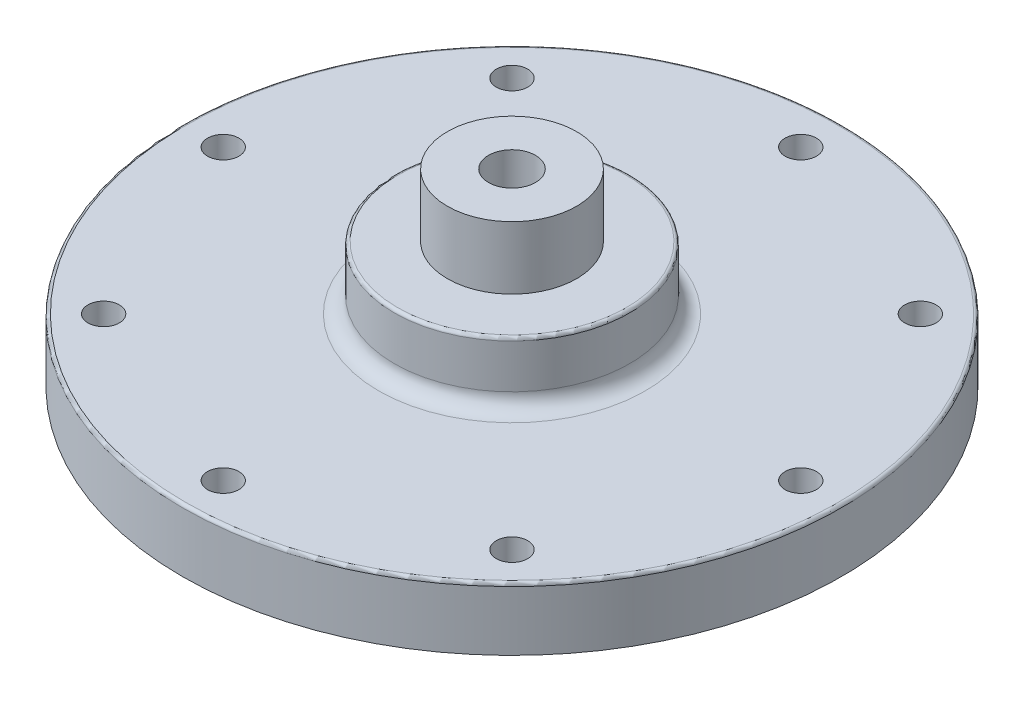
ISO-10303-21;
HEADER;
FILE_DESCRIPTION(('STEP AP214'),'2;1');
FILE_NAME('part.step','',(''),(''),'','','');
FILE_SCHEMA(('AUTOMOTIVE_DESIGN { 1 0 10303 214 1 1 1 1 }'));
ENDSEC;
DATA;
#1=APPLICATION_CONTEXT('core data for automotive mechanical design processes');
#2=APPLICATION_PROTOCOL_DEFINITION('international standard','automotive_design',2000,#1);
#3=PRODUCT_CONTEXT('',#1,'mechanical');
#4=PRODUCT('Part','Part','',(#3));
#5=PRODUCT_RELATED_PRODUCT_CATEGORY('part','',(#4));
#6=PRODUCT_DEFINITION_FORMATION('','',#4);
#7=PRODUCT_DEFINITION_CONTEXT('part definition',#1,'design');
#8=PRODUCT_DEFINITION('design','',#6,#7);
#9=PRODUCT_DEFINITION_SHAPE('','',#8);
#10=(LENGTH_UNIT() NAMED_UNIT(*) SI_UNIT(.MILLI.,.METRE.));
#11=(NAMED_UNIT(*) PLANE_ANGLE_UNIT() SI_UNIT($,.RADIAN.));
#12=(NAMED_UNIT(*) SI_UNIT($,.STERADIAN.) SOLID_ANGLE_UNIT());
#13=UNCERTAINTY_MEASURE_WITH_UNIT(LENGTH_MEASURE(1.E-05),#10,'distance_accuracy_value','');
#14=(GEOMETRIC_REPRESENTATION_CONTEXT(3) GLOBAL_UNCERTAINTY_ASSIGNED_CONTEXT((#13)) GLOBAL_UNIT_ASSIGNED_CONTEXT((#10,
#11,#12)) REPRESENTATION_CONTEXT('',''));
#15=CARTESIAN_POINT('',(0.,0.,0.));
#16=DIRECTION('',(0.,0.,1.));
#17=DIRECTION('',(1.,0.,0.));
#18=AXIS2_PLACEMENT_3D('',#15,#16,#17);
#19=CARTESIAN_POINT('',(0.,12.7,0.));
#20=DIRECTION('',(0.,-1.,0.));
#21=DIRECTION('',(0.,0.,-1.));
#22=AXIS2_PLACEMENT_3D('',#19,#20,#21);
#23=CYLINDRICAL_SURFACE('',#22,66.675);
#24=CARTESIAN_POINT('',(0.,12.065,0.));
#25=DIRECTION('',(0.,1.,0.));
#26=DIRECTION('',(0.,0.,1.));
#27=AXIS2_PLACEMENT_3D('',#24,#25,#26);
#28=CIRCLE('',#27,66.675);
#29=CARTESIAN_POINT('',(0.,12.065,66.675));
#30=VERTEX_POINT('',#29);
#31=EDGE_CURVE('E12',#30,#30,#28,.F.);
#32=ORIENTED_EDGE('',*,*,#31,.T.);
#33=EDGE_LOOP('',(#32));
#34=FACE_BOUND('',#33,.T.);
#35=CARTESIAN_POINT('',(0.,0.,0.));
#36=DIRECTION('',(0.,1.,0.));
#37=DIRECTION('',(0.,0.,1.));
#38=AXIS2_PLACEMENT_3D('',#35,#36,#37);
#39=CIRCLE('',#38,66.675);
#40=CARTESIAN_POINT('',(0.,0.,66.675));
#41=VERTEX_POINT('',#40);
#42=EDGE_CURVE('E183',#41,#41,#39,.T.);
#43=ORIENTED_EDGE('',*,*,#42,.T.);
#44=EDGE_LOOP('',(#43));
#45=FACE_BOUND('',#44,.T.);
#46=ADVANCED_FACE('F42',(#34,#45),#23,.T.);
#47=CARTESIAN_POINT('',(0.,12.7,0.));
#48=DIRECTION('',(0.,1.,0.));
#49=DIRECTION('',(0.,0.,1.));
#50=AXIS2_PLACEMENT_3D('',#47,#48,#49);
#51=PLANE('',#50);
#52=CARTESIAN_POINT('',(0.,12.7,0.));
#53=DIRECTION('',(0.,1.,0.));
#54=DIRECTION('',(0.,0.,1.));
#55=AXIS2_PLACEMENT_3D('',#52,#53,#54);
#56=CIRCLE('',#55,66.04);
#57=CARTESIAN_POINT('',(0.,12.7,66.04));
#58=VERTEX_POINT('',#57);
#59=EDGE_CURVE('E51',#58,#58,#56,.T.);
#60=ORIENTED_EDGE('',*,*,#59,.T.);
#61=EDGE_LOOP('',(#60));
#62=FACE_BOUND('',#61,.T.);
#63=CARTESIAN_POINT('',(0.,12.7,0.));
#64=DIRECTION('',(0.,1.,0.));
#65=DIRECTION('',(0.,0.,1.));
#66=AXIS2_PLACEMENT_3D('',#63,#64,#65);
#67=CIRCLE('',#66,26.9875);
#68=CARTESIAN_POINT('',(0.,12.7,26.9875));
#69=VERTEX_POINT('',#68);
#70=EDGE_CURVE('E182',#69,#69,#67,.F.);
#71=ORIENTED_EDGE('',*,*,#70,.T.);
#72=EDGE_LOOP('',(#71));
#73=FACE_BOUND('',#72,.T.);
#74=CARTESIAN_POINT('',(41.3091781569223,12.7,41.3091781569164));
#75=DIRECTION('',(0.,1.,0.));
#76=DIRECTION('',(0.,0.,1.));
#77=AXIS2_PLACEMENT_3D('',#74,#75,#76);
#78=CIRCLE('',#77,3.17499999999999);
#79=CARTESIAN_POINT('',(41.3091781569223,12.7,44.4841781569163));
#80=VERTEX_POINT('',#79);
#81=EDGE_CURVE('E364',#80,#80,#78,.T.);
#82=ORIENTED_EDGE('',*,*,#81,.F.);
#83=EDGE_LOOP('',(#82));
#84=FACE_BOUND('',#83,.T.);
#85=CARTESIAN_POINT('',(4.96688002157137E-12,12.7,58.42));
#86=DIRECTION('',(0.,1.,0.));
#87=DIRECTION('',(0.,0.,1.));
#88=AXIS2_PLACEMENT_3D('',#85,#86,#87);
#89=CIRCLE('',#88,3.17499999999999);
#90=CARTESIAN_POINT('',(4.96688002157137E-12,12.7,61.595));
#91=VERTEX_POINT('',#90);
#92=EDGE_CURVE('E372',#91,#91,#89,.T.);
#93=ORIENTED_EDGE('',*,*,#92,.F.);
#94=EDGE_LOOP('',(#93));
#95=FACE_BOUND('',#94,.T.);
#96=CARTESIAN_POINT('',(-41.3091781569139,12.7,41.3091781569199));
#97=DIRECTION('',(0.,1.,0.));
#98=DIRECTION('',(0.,0.,1.));
#99=AXIS2_PLACEMENT_3D('',#96,#97,#98);
#100=CIRCLE('',#99,3.17499999999998);
#101=CARTESIAN_POINT('',(-41.3091781569139,12.7,44.4841781569199));
#102=VERTEX_POINT('',#101);
#103=EDGE_CURVE('E380',#102,#102,#100,.T.);
#104=ORIENTED_EDGE('',*,*,#103,.F.);
#105=EDGE_LOOP('',(#104));
#106=FACE_BOUND('',#105,.T.);
#107=CARTESIAN_POINT('',(-58.4199999999975,12.7,2.4905943973863E-12));
#108=DIRECTION('',(0.,1.,0.));
#109=DIRECTION('',(0.,0.,1.));
#110=AXIS2_PLACEMENT_3D('',#107,#108,#109);
#111=CIRCLE('',#110,3.17499999999999);
#112=CARTESIAN_POINT('',(-58.4199999999975,12.7,3.17500000000248));
#113=VERTEX_POINT('',#112);
#114=EDGE_CURVE('E388',#113,#113,#111,.T.);
#115=ORIENTED_EDGE('',*,*,#114,.F.);
#116=EDGE_LOOP('',(#115));
#117=FACE_BOUND('',#116,.T.);
#118=CARTESIAN_POINT('',(-41.3091781569174,12.7,-41.3091781569163));
#119=DIRECTION('',(0.,1.,0.));
#120=DIRECTION('',(0.,0.,1.));
#121=AXIS2_PLACEMENT_3D('',#118,#119,#120);
#122=CIRCLE('',#121,3.17499999999998);
#123=CARTESIAN_POINT('',(-41.3091781569174,12.7,-38.1341781569164));
#124=VERTEX_POINT('',#123);
#125=EDGE_CURVE('E396',#124,#124,#122,.T.);
#126=ORIENTED_EDGE('',*,*,#125,.F.);
#127=EDGE_LOOP('',(#126));
#128=FACE_BOUND('',#127,.T.);
#129=CARTESIAN_POINT('',(0.,12.7,-58.42));
#130=DIRECTION('',(0.,1.,0.));
#131=DIRECTION('',(0.,0.,1.));
#132=AXIS2_PLACEMENT_3D('',#129,#130,#131);
#133=CIRCLE('',#132,3.17499999999999);
#134=CARTESIAN_POINT('',(0.,12.7,-55.245));
#135=VERTEX_POINT('',#134);
#136=EDGE_CURVE('E404',#135,#135,#133,.T.);
#137=ORIENTED_EDGE('',*,*,#136,.F.);
#138=EDGE_LOOP('',(#137));
#139=FACE_BOUND('',#138,.T.);
#140=CARTESIAN_POINT('',(41.3091781569188,12.7,-41.3091781569199));
#141=DIRECTION('',(0.,1.,0.));
#142=DIRECTION('',(0.,0.,1.));
#143=AXIS2_PLACEMENT_3D('',#140,#141,#142);
#144=CIRCLE('',#143,3.17499999999998);
#145=CARTESIAN_POINT('',(41.3091781569188,12.7,-38.1341781569199));
#146=VERTEX_POINT('',#145);
#147=EDGE_CURVE('E312',#146,#146,#144,.T.);
#148=ORIENTED_EDGE('',*,*,#147,.F.);
#149=EDGE_LOOP('',(#148));
#150=FACE_BOUND('',#149,.T.);
#151=CARTESIAN_POINT('',(58.4200000000025,12.7,-2.48344001078568E-12));
#152=DIRECTION('',(0.,1.,0.));
#153=DIRECTION('',(0.,0.,1.));
#154=AXIS2_PLACEMENT_3D('',#151,#152,#153);
#155=CIRCLE('',#154,3.17499999999999);
#156=CARTESIAN_POINT('',(58.4200000000025,12.7,3.17499999999751));
#157=VERTEX_POINT('',#156);
#158=EDGE_CURVE('E303',#157,#157,#155,.T.);
#159=ORIENTED_EDGE('',*,*,#158,.F.);
#160=EDGE_LOOP('',(#159));
#161=FACE_BOUND('',#160,.T.);
#162=ADVANCED_FACE('F198',(#62,#73,#84,#95,#106,#117,#128,#139,#150,#161),#51,.T.);
#163=CARTESIAN_POINT('',(0.,0.,0.));
#164=DIRECTION('',(0.,1.,0.));
#165=DIRECTION('',(0.,0.,1.));
#166=AXIS2_PLACEMENT_3D('',#163,#164,#165);
#167=PLANE('',#166);
#168=CARTESIAN_POINT('',(0.,0.,0.));
#169=DIRECTION('',(0.,-1.,0.));
#170=DIRECTION('',(0.,0.,-1.));
#171=AXIS2_PLACEMENT_3D('',#168,#169,#170);
#172=CIRCLE('',#171,23.8125);
#173=CARTESIAN_POINT('',(0.,0.,-23.8125));
#174=VERTEX_POINT('',#173);
#175=EDGE_CURVE('E169',#174,#174,#172,.T.);
#176=ORIENTED_EDGE('',*,*,#175,.F.);
#177=EDGE_LOOP('',(#176));
#178=FACE_BOUND('',#177,.T.);
#179=CARTESIAN_POINT('',(-22.3563661187695,0.,53.9730422893092));
#180=DIRECTION('',(0.,-1.,0.));
#181=DIRECTION('',(0.,0.,-1.));
#182=AXIS2_PLACEMENT_3D('',#179,#180,#181);
#183=CIRCLE('',#182,3.175);
#184=CARTESIAN_POINT('',(-22.3563661187695,0.,50.7980422893092));
#185=VERTEX_POINT('',#184);
#186=EDGE_CURVE('E348',#185,#185,#183,.T.);
#187=ORIENTED_EDGE('',*,*,#186,.F.);
#188=EDGE_LOOP('',(#187));
#189=FACE_BOUND('',#188,.T.);
#190=CARTESIAN_POINT('',(22.3563661187682,0.,-53.9730422893095));
#191=DIRECTION('',(0.,-1.,0.));
#192=DIRECTION('',(0.,0.,-1.));
#193=AXIS2_PLACEMENT_3D('',#190,#191,#192);
#194=CIRCLE('',#193,3.175);
#195=CARTESIAN_POINT('',(22.3563661187682,0.,-57.1480422893095));
#196=VERTEX_POINT('',#195);
#197=EDGE_CURVE('E356',#196,#196,#194,.T.);
#198=ORIENTED_EDGE('',*,*,#197,.F.);
#199=EDGE_LOOP('',(#198));
#200=FACE_BOUND('',#199,.T.);
#201=CARTESIAN_POINT('',(41.3091781569223,0.,41.3091781569164));
#202=DIRECTION('',(0.,1.,0.));
#203=DIRECTION('',(0.,0.,1.));
#204=AXIS2_PLACEMENT_3D('',#201,#202,#203);
#205=CIRCLE('',#204,3.17499999999999);
#206=CARTESIAN_POINT('',(41.3091781569223,0.,44.4841781569163));
#207=VERTEX_POINT('',#206);
#208=EDGE_CURVE('E368',#207,#207,#205,.T.);
#209=ORIENTED_EDGE('',*,*,#208,.T.);
#210=EDGE_LOOP('',(#209));
#211=FACE_BOUND('',#210,.T.);
#212=CARTESIAN_POINT('',(4.96688002157137E-12,0.,58.42));
#213=DIRECTION('',(0.,1.,0.));
#214=DIRECTION('',(0.,0.,1.));
#215=AXIS2_PLACEMENT_3D('',#212,#213,#214);
#216=CIRCLE('',#215,3.17499999999999);
#217=CARTESIAN_POINT('',(4.96688002157137E-12,0.,61.595));
#218=VERTEX_POINT('',#217);
#219=EDGE_CURVE('E376',#218,#218,#216,.T.);
#220=ORIENTED_EDGE('',*,*,#219,.T.);
#221=EDGE_LOOP('',(#220));
#222=FACE_BOUND('',#221,.T.);
#223=CARTESIAN_POINT('',(-41.3091781569139,0.,41.3091781569199));
#224=DIRECTION('',(0.,1.,0.));
#225=DIRECTION('',(0.,0.,1.));
#226=AXIS2_PLACEMENT_3D('',#223,#224,#225);
#227=CIRCLE('',#226,3.17499999999999);
#228=CARTESIAN_POINT('',(-41.3091781569139,0.,44.4841781569199));
#229=VERTEX_POINT('',#228);
#230=EDGE_CURVE('E384',#229,#229,#227,.T.);
#231=ORIENTED_EDGE('',*,*,#230,.T.);
#232=EDGE_LOOP('',(#231));
#233=FACE_BOUND('',#232,.T.);
#234=CARTESIAN_POINT('',(-58.4199999999975,0.,2.4905943973863E-12));
#235=DIRECTION('',(0.,1.,0.));
#236=DIRECTION('',(0.,0.,1.));
#237=AXIS2_PLACEMENT_3D('',#234,#235,#236);
#238=CIRCLE('',#237,3.17499999999999);
#239=CARTESIAN_POINT('',(-58.4199999999975,0.,3.17500000000248));
#240=VERTEX_POINT('',#239);
#241=EDGE_CURVE('E392',#240,#240,#238,.T.);
#242=ORIENTED_EDGE('',*,*,#241,.T.);
#243=EDGE_LOOP('',(#242));
#244=FACE_BOUND('',#243,.T.);
#245=CARTESIAN_POINT('',(-41.3091781569174,0.,-41.3091781569163));
#246=DIRECTION('',(0.,1.,0.));
#247=DIRECTION('',(0.,0.,1.));
#248=AXIS2_PLACEMENT_3D('',#245,#246,#247);
#249=CIRCLE('',#248,3.17499999999999);
#250=CARTESIAN_POINT('',(-41.3091781569174,0.,-38.1341781569164));
#251=VERTEX_POINT('',#250);
#252=EDGE_CURVE('E400',#251,#251,#249,.T.);
#253=ORIENTED_EDGE('',*,*,#252,.T.);
#254=EDGE_LOOP('',(#253));
#255=FACE_BOUND('',#254,.T.);
#256=CARTESIAN_POINT('',(0.,0.,-58.42));
#257=DIRECTION('',(0.,1.,0.));
#258=DIRECTION('',(0.,0.,1.));
#259=AXIS2_PLACEMENT_3D('',#256,#257,#258);
#260=CIRCLE('',#259,3.17499999999999);
#261=CARTESIAN_POINT('',(0.,0.,-55.245));
#262=VERTEX_POINT('',#261);
#263=EDGE_CURVE('E408',#262,#262,#260,.T.);
#264=ORIENTED_EDGE('',*,*,#263,.T.);
#265=EDGE_LOOP('',(#264));
#266=FACE_BOUND('',#265,.T.);
#267=CARTESIAN_POINT('',(41.3091781569188,0.,-41.3091781569199));
#268=DIRECTION('',(0.,1.,0.));
#269=DIRECTION('',(0.,0.,1.));
#270=AXIS2_PLACEMENT_3D('',#267,#268,#269);
#271=CIRCLE('',#270,3.17499999999999);
#272=CARTESIAN_POINT('',(41.3091781569188,0.,-38.1341781569199));
#273=VERTEX_POINT('',#272);
#274=EDGE_CURVE('E306',#273,#273,#271,.T.);
#275=ORIENTED_EDGE('',*,*,#274,.T.);
#276=EDGE_LOOP('',(#275));
#277=FACE_BOUND('',#276,.T.);
#278=CARTESIAN_POINT('',(58.4200000000025,0.,-2.48344001078568E-12));
#279=DIRECTION('',(0.,1.,0.));
#280=DIRECTION('',(0.,0.,1.));
#281=AXIS2_PLACEMENT_3D('',#278,#279,#280);
#282=CIRCLE('',#281,3.17499999999999);
#283=CARTESIAN_POINT('',(58.4200000000025,0.,3.17499999999751));
#284=VERTEX_POINT('',#283);
#285=EDGE_CURVE('E300',#284,#284,#282,.T.);
#286=ORIENTED_EDGE('',*,*,#285,.T.);
#287=EDGE_LOOP('',(#286));
#288=FACE_BOUND('',#287,.T.);
#289=ORIENTED_EDGE('',*,*,#42,.F.);
#290=EDGE_LOOP('',(#289));
#291=FACE_BOUND('',#290,.T.);
#292=ADVANCED_FACE('F216',(#178,#189,#200,#211,#222,#233,#244,#255,#266,#277,#288,#291),#167,.F.);
#293=CARTESIAN_POINT('',(58.4200000000025,12.7,-2.48344001078568E-12));
#294=DIRECTION('',(0.,1.,0.));
#295=DIRECTION('',(0.,0.,1.));
#296=AXIS2_PLACEMENT_3D('',#293,#294,#295);
#297=CYLINDRICAL_SURFACE('',#296,3.17499999999999);
#298=ORIENTED_EDGE('',*,*,#285,.F.);
#299=EDGE_LOOP('',(#298));
#300=FACE_BOUND('',#299,.T.);
#301=ORIENTED_EDGE('',*,*,#158,.T.);
#302=EDGE_LOOP('',(#301));
#303=FACE_BOUND('',#302,.T.);
#304=ADVANCED_FACE('F289',(#300,#303),#297,.F.);
#305=CARTESIAN_POINT('',(41.3091781569188,12.7,-41.3091781569199));
#306=DIRECTION('',(0.,1.,0.));
#307=DIRECTION('',(0.,0.,1.));
#308=AXIS2_PLACEMENT_3D('',#305,#306,#307);
#309=CYLINDRICAL_SURFACE('',#308,3.17499999999999);
#310=ORIENTED_EDGE('',*,*,#274,.F.);
#311=EDGE_LOOP('',(#310));
#312=FACE_BOUND('',#311,.T.);
#313=ORIENTED_EDGE('',*,*,#147,.T.);
#314=EDGE_LOOP('',(#313));
#315=FACE_BOUND('',#314,.T.);
#316=ADVANCED_FACE('F285',(#312,#315),#309,.F.);
#317=CARTESIAN_POINT('',(0.,12.7,-58.42));
#318=DIRECTION('',(0.,1.,0.));
#319=DIRECTION('',(0.,0.,1.));
#320=AXIS2_PLACEMENT_3D('',#317,#318,#319);
#321=CYLINDRICAL_SURFACE('',#320,3.17499999999999);
#322=ORIENTED_EDGE('',*,*,#263,.F.);
#323=EDGE_LOOP('',(#322));
#324=FACE_BOUND('',#323,.T.);
#325=ORIENTED_EDGE('',*,*,#136,.T.);
#326=EDGE_LOOP('',(#325));
#327=FACE_BOUND('',#326,.T.);
#328=ADVANCED_FACE('F281',(#324,#327),#321,.F.);
#329=CARTESIAN_POINT('',(-41.3091781569174,12.7,-41.3091781569163));
#330=DIRECTION('',(0.,1.,0.));
#331=DIRECTION('',(0.,0.,1.));
#332=AXIS2_PLACEMENT_3D('',#329,#330,#331);
#333=CYLINDRICAL_SURFACE('',#332,3.17499999999999);
#334=ORIENTED_EDGE('',*,*,#252,.F.);
#335=EDGE_LOOP('',(#334));
#336=FACE_BOUND('',#335,.T.);
#337=ORIENTED_EDGE('',*,*,#125,.T.);
#338=EDGE_LOOP('',(#337));
#339=FACE_BOUND('',#338,.T.);
#340=ADVANCED_FACE('F277',(#336,#339),#333,.F.);
#341=CARTESIAN_POINT('',(-58.4199999999975,12.7,2.4905943973863E-12));
#342=DIRECTION('',(0.,1.,0.));
#343=DIRECTION('',(0.,0.,1.));
#344=AXIS2_PLACEMENT_3D('',#341,#342,#343);
#345=CYLINDRICAL_SURFACE('',#344,3.17499999999999);
#346=ORIENTED_EDGE('',*,*,#241,.F.);
#347=EDGE_LOOP('',(#346));
#348=FACE_BOUND('',#347,.T.);
#349=ORIENTED_EDGE('',*,*,#114,.T.);
#350=EDGE_LOOP('',(#349));
#351=FACE_BOUND('',#350,.T.);
#352=ADVANCED_FACE('F273',(#348,#351),#345,.F.);
#353=CARTESIAN_POINT('',(-41.3091781569139,12.7,41.3091781569199));
#354=DIRECTION('',(0.,1.,0.));
#355=DIRECTION('',(0.,0.,1.));
#356=AXIS2_PLACEMENT_3D('',#353,#354,#355);
#357=CYLINDRICAL_SURFACE('',#356,3.17499999999999);
#358=ORIENTED_EDGE('',*,*,#230,.F.);
#359=EDGE_LOOP('',(#358));
#360=FACE_BOUND('',#359,.T.);
#361=ORIENTED_EDGE('',*,*,#103,.T.);
#362=EDGE_LOOP('',(#361));
#363=FACE_BOUND('',#362,.T.);
#364=ADVANCED_FACE('F269',(#360,#363),#357,.F.);
#365=CARTESIAN_POINT('',(4.96688002157137E-12,12.7,58.42));
#366=DIRECTION('',(0.,1.,0.));
#367=DIRECTION('',(0.,0.,1.));
#368=AXIS2_PLACEMENT_3D('',#365,#366,#367);
#369=CYLINDRICAL_SURFACE('',#368,3.17499999999999);
#370=ORIENTED_EDGE('',*,*,#219,.F.);
#371=EDGE_LOOP('',(#370));
#372=FACE_BOUND('',#371,.T.);
#373=ORIENTED_EDGE('',*,*,#92,.T.);
#374=EDGE_LOOP('',(#373));
#375=FACE_BOUND('',#374,.T.);
#376=ADVANCED_FACE('F265',(#372,#375),#369,.F.);
#377=CARTESIAN_POINT('',(41.3091781569223,12.7,41.3091781569164));
#378=DIRECTION('',(0.,1.,0.));
#379=DIRECTION('',(0.,0.,1.));
#380=AXIS2_PLACEMENT_3D('',#377,#378,#379);
#381=CYLINDRICAL_SURFACE('',#380,3.17499999999999);
#382=ORIENTED_EDGE('',*,*,#208,.F.);
#383=EDGE_LOOP('',(#382));
#384=FACE_BOUND('',#383,.T.);
#385=ORIENTED_EDGE('',*,*,#81,.T.);
#386=EDGE_LOOP('',(#385));
#387=FACE_BOUND('',#386,.T.);
#388=ADVANCED_FACE('F262',(#384,#387),#381,.F.);
#389=CARTESIAN_POINT('',(22.3563661187682,6.35,-53.9730422893095));
#390=DIRECTION('',(0.,-1.,0.));
#391=DIRECTION('',(0.,0.,-1.));
#392=AXIS2_PLACEMENT_3D('',#389,#390,#391);
#393=CONICAL_SURFACE('',#392,3.175,1.02974425867665);
#394=CARTESIAN_POINT('',(22.3563661187682,8.25773246541251,-53.9730422893095));
#395=VERTEX_POINT('',#394);
#396=VERTEX_LOOP('',#395);
#397=FACE_BOUND('',#396,.T.);
#398=CARTESIAN_POINT('',(22.3563661187682,6.35,-53.9730422893095));
#399=DIRECTION('',(0.,-1.,0.));
#400=DIRECTION('',(0.,0.,-1.));
#401=AXIS2_PLACEMENT_3D('',#398,#399,#400);
#402=CIRCLE('',#401,3.175);
#403=CARTESIAN_POINT('',(22.3563661187682,6.35,-57.1480422893095));
#404=VERTEX_POINT('',#403);
#405=EDGE_CURVE('E360',#404,#404,#402,.T.);
#406=ORIENTED_EDGE('',*,*,#405,.T.);
#407=EDGE_LOOP('',(#406));
#408=FACE_BOUND('',#407,.T.);
#409=ADVANCED_FACE('F258',(#397,#408),#393,.F.);
#410=CARTESIAN_POINT('',(22.3563661187682,0.,-53.9730422893095));
#411=DIRECTION('',(0.,-1.,0.));
#412=DIRECTION('',(0.,0.,-1.));
#413=AXIS2_PLACEMENT_3D('',#410,#411,#412);
#414=CYLINDRICAL_SURFACE('',#413,3.175);
#415=ORIENTED_EDGE('',*,*,#405,.F.);
#416=EDGE_LOOP('',(#415));
#417=FACE_BOUND('',#416,.T.);
#418=ORIENTED_EDGE('',*,*,#197,.T.);
#419=EDGE_LOOP('',(#418));
#420=FACE_BOUND('',#419,.T.);
#421=ADVANCED_FACE('F255',(#417,#420),#414,.F.);
#422=CARTESIAN_POINT('',(-22.3563661187695,6.35,53.9730422893092));
#423=DIRECTION('',(0.,-1.,0.));
#424=DIRECTION('',(0.,0.,-1.));
#425=AXIS2_PLACEMENT_3D('',#422,#423,#424);
#426=CONICAL_SURFACE('',#425,3.175,1.02974425867665);
#427=CARTESIAN_POINT('',(-22.3563661187695,8.25773246541251,53.9730422893092));
#428=VERTEX_POINT('',#427);
#429=VERTEX_LOOP('',#428);
#430=FACE_BOUND('',#429,.T.);
#431=CARTESIAN_POINT('',(-22.3563661187695,6.35,53.9730422893092));
#432=DIRECTION('',(0.,-1.,0.));
#433=DIRECTION('',(0.,0.,-1.));
#434=AXIS2_PLACEMENT_3D('',#431,#432,#433);
#435=CIRCLE('',#434,3.175);
#436=CARTESIAN_POINT('',(-22.3563661187695,6.35,50.7980422893092));
#437=VERTEX_POINT('',#436);
#438=EDGE_CURVE('E352',#437,#437,#435,.T.);
#439=ORIENTED_EDGE('',*,*,#438,.T.);
#440=EDGE_LOOP('',(#439));
#441=FACE_BOUND('',#440,.T.);
#442=ADVANCED_FACE('F251',(#430,#441),#426,.F.);
#443=CARTESIAN_POINT('',(-22.3563661187695,0.,53.9730422893092));
#444=DIRECTION('',(0.,-1.,0.));
#445=DIRECTION('',(0.,0.,-1.));
#446=AXIS2_PLACEMENT_3D('',#443,#444,#445);
#447=CYLINDRICAL_SURFACE('',#446,3.175);
#448=ORIENTED_EDGE('',*,*,#438,.F.);
#449=EDGE_LOOP('',(#448));
#450=FACE_BOUND('',#449,.T.);
#451=ORIENTED_EDGE('',*,*,#186,.T.);
#452=EDGE_LOOP('',(#451));
#453=FACE_BOUND('',#452,.T.);
#454=ADVANCED_FACE('F244',(#450,#453),#447,.F.);
#455=CARTESIAN_POINT('',(0.,25.4,0.));
#456=DIRECTION('',(0.,1.,0.));
#457=DIRECTION('',(0.,0.,1.));
#458=AXIS2_PLACEMENT_3D('',#455,#456,#457);
#459=PLANE('',#458);
#460=CARTESIAN_POINT('',(0.,25.4,0.));
#461=DIRECTION('',(0.,1.,0.));
#462=DIRECTION('',(0.,0.,1.));
#463=AXIS2_PLACEMENT_3D('',#460,#461,#462);
#464=CIRCLE('',#463,23.1775);
#465=CARTESIAN_POINT('',(0.,25.4,23.1775));
#466=VERTEX_POINT('',#465);
#467=EDGE_CURVE('E187',#466,#466,#464,.T.);
#468=ORIENTED_EDGE('',*,*,#467,.T.);
#469=EDGE_LOOP('',(#468));
#470=FACE_BOUND('',#469,.T.);
#471=CARTESIAN_POINT('',(0.,25.4,0.));
#472=DIRECTION('',(0.,1.,0.));
#473=DIRECTION('',(0.,0.,1.));
#474=AXIS2_PLACEMENT_3D('',#471,#472,#473);
#475=CIRCLE('',#474,13.081);
#476=CARTESIAN_POINT('',(0.,25.4,13.081));
#477=VERTEX_POINT('',#476);
#478=EDGE_CURVE('E335',#477,#477,#475,.T.);
#479=ORIENTED_EDGE('',*,*,#478,.F.);
#480=EDGE_LOOP('',(#479));
#481=FACE_BOUND('',#480,.T.);
#482=ADVANCED_FACE('F234',(#470,#481),#459,.T.);
#483=CARTESIAN_POINT('',(0.,25.4,0.));
#484=DIRECTION('',(0.,-1.,0.));
#485=DIRECTION('',(0.,0.,-1.));
#486=AXIS2_PLACEMENT_3D('',#483,#484,#485);
#487=CYLINDRICAL_SURFACE('',#486,23.8125);
#488=CARTESIAN_POINT('',(0.,24.765,0.));
#489=DIRECTION('',(0.,1.,0.));
#490=DIRECTION('',(0.,0.,1.));
#491=AXIS2_PLACEMENT_3D('',#488,#489,#490);
#492=CIRCLE('',#491,23.8125);
#493=CARTESIAN_POINT('',(0.,24.765,23.8125));
#494=VERTEX_POINT('',#493);
#495=EDGE_CURVE('E191',#494,#494,#492,.F.);
#496=ORIENTED_EDGE('',*,*,#495,.T.);
#497=EDGE_LOOP('',(#496));
#498=FACE_BOUND('',#497,.T.);
#499=CARTESIAN_POINT('',(0.,15.875,0.));
#500=DIRECTION('',(0.,1.,0.));
#501=DIRECTION('',(0.,0.,1.));
#502=AXIS2_PLACEMENT_3D('',#499,#500,#501);
#503=CIRCLE('',#502,23.8125);
#504=CARTESIAN_POINT('',(0.,15.875,23.8125));
#505=VERTEX_POINT('',#504);
#506=EDGE_CURVE('E178',#505,#505,#503,.T.);
#507=ORIENTED_EDGE('',*,*,#506,.T.);
#508=EDGE_LOOP('',(#507));
#509=FACE_BOUND('',#508,.T.);
#510=ADVANCED_FACE('F231',(#498,#509),#487,.T.);
#511=CARTESIAN_POINT('',(0.,25.4,0.));
#512=DIRECTION('',(0.,1.,0.));
#513=DIRECTION('',(0.,0.,1.));
#514=AXIS2_PLACEMENT_3D('',#511,#512,#513);
#515=PLANE('',#514);
#516=CARTESIAN_POINT('',(0.,25.4,0.));
#517=DIRECTION('',(0.,1.,0.));
#518=DIRECTION('',(0.,0.,1.));
#519=AXIS2_PLACEMENT_3D('',#516,#517,#518);
#520=CIRCLE('',#519,4.7625);
#521=CARTESIAN_POINT('',(0.,25.4,4.7625));
#522=VERTEX_POINT('',#521);
#523=EDGE_CURVE('E327',#522,#522,#520,.T.);
#524=ORIENTED_EDGE('',*,*,#523,.T.);
#525=EDGE_LOOP('',(#524));
#526=FACE_BOUND('',#525,.T.);
#527=CARTESIAN_POINT('',(0.,25.4,0.));
#528=DIRECTION('',(0.,1.,0.));
#529=DIRECTION('',(0.,0.,1.));
#530=AXIS2_PLACEMENT_3D('',#527,#528,#529);
#531=CIRCLE('',#530,12.7);
#532=CARTESIAN_POINT('',(0.,25.4,12.7));
#533=VERTEX_POINT('',#532);
#534=EDGE_CURVE('E341',#533,#533,#531,.T.);
#535=ORIENTED_EDGE('',*,*,#534,.F.);
#536=EDGE_LOOP('',(#535));
#537=FACE_BOUND('',#536,.T.);
#538=ADVANCED_FACE('F233',(#526,#537),#515,.F.);
#539=CARTESIAN_POINT('',(0.,38.1,0.));
#540=DIRECTION('',(0.,1.,0.));
#541=DIRECTION('',(0.,0.,1.));
#542=AXIS2_PLACEMENT_3D('',#539,#540,#541);
#543=PLANE('',#542);
#544=CARTESIAN_POINT('',(0.,38.1,0.));
#545=DIRECTION('',(0.,1.,0.));
#546=DIRECTION('',(0.,0.,1.));
#547=AXIS2_PLACEMENT_3D('',#544,#545,#546);
#548=CIRCLE('',#547,13.081);
#549=CARTESIAN_POINT('',(0.,38.1,13.081));
#550=VERTEX_POINT('',#549);
#551=EDGE_CURVE('E337',#550,#550,#548,.T.);
#552=ORIENTED_EDGE('',*,*,#551,.T.);
#553=EDGE_LOOP('',(#552));
#554=FACE_BOUND('',#553,.T.);
#555=CARTESIAN_POINT('',(0.,38.1,0.));
#556=DIRECTION('',(0.,1.,0.));
#557=DIRECTION('',(0.,0.,1.));
#558=AXIS2_PLACEMENT_3D('',#555,#556,#557);
#559=CIRCLE('',#558,4.7625);
#560=CARTESIAN_POINT('',(0.,38.1,4.7625));
#561=VERTEX_POINT('',#560);
#562=EDGE_CURVE('E330',#561,#561,#559,.T.);
#563=ORIENTED_EDGE('',*,*,#562,.F.);
#564=EDGE_LOOP('',(#563));
#565=FACE_BOUND('',#564,.T.);
#566=ADVANCED_FACE('F241',(#554,#565),#543,.T.);
#567=CARTESIAN_POINT('',(0.,38.1,0.));
#568=DIRECTION('',(0.,-1.,0.));
#569=DIRECTION('',(0.,0.,-1.));
#570=AXIS2_PLACEMENT_3D('',#567,#568,#569);
#571=CYLINDRICAL_SURFACE('',#570,13.081);
#572=ORIENTED_EDGE('',*,*,#551,.F.);
#573=EDGE_LOOP('',(#572));
#574=FACE_BOUND('',#573,.T.);
#575=ORIENTED_EDGE('',*,*,#478,.T.);
#576=EDGE_LOOP('',(#575));
#577=FACE_BOUND('',#576,.T.);
#578=ADVANCED_FACE('F581',(#574,#577),#571,.T.);
#579=CARTESIAN_POINT('',(0.,38.1,0.));
#580=DIRECTION('',(0.,-1.,0.));
#581=DIRECTION('',(0.,0.,-1.));
#582=AXIS2_PLACEMENT_3D('',#579,#580,#581);
#583=CYLINDRICAL_SURFACE('',#582,4.7625);
#584=ORIENTED_EDGE('',*,*,#562,.T.);
#585=EDGE_LOOP('',(#584));
#586=FACE_BOUND('',#585,.T.);
#587=ORIENTED_EDGE('',*,*,#523,.F.);
#588=EDGE_LOOP('',(#587));
#589=FACE_BOUND('',#588,.T.);
#590=ADVANCED_FACE('F466',(#586,#589),#583,.F.);
#591=CARTESIAN_POINT('',(0.,25.4,0.));
#592=DIRECTION('',(0.,-1.,0.));
#593=DIRECTION('',(0.,0.,-1.));
#594=AXIS2_PLACEMENT_3D('',#591,#592,#593);
#595=CYLINDRICAL_SURFACE('',#594,12.7);
#596=ORIENTED_EDGE('',*,*,#534,.T.);
#597=EDGE_LOOP('',(#596));
#598=FACE_BOUND('',#597,.T.);
#599=CARTESIAN_POINT('',(0.,6.35,0.));
#600=DIRECTION('',(0.,-1.,0.));
#601=DIRECTION('',(0.,0.,-1.));
#602=AXIS2_PLACEMENT_3D('',#599,#600,#601);
#603=CIRCLE('',#602,12.7);
#604=CARTESIAN_POINT('',(0.,6.35,-12.7));
#605=VERTEX_POINT('',#604);
#606=EDGE_CURVE('E111',#605,#605,#603,.T.);
#607=ORIENTED_EDGE('',*,*,#606,.T.);
#608=EDGE_LOOP('',(#607));
#609=FACE_BOUND('',#608,.T.);
#610=ADVANCED_FACE('F323',(#598,#609),#595,.F.);
#611=CARTESIAN_POINT('',(0.,5.715,0.));
#612=DIRECTION('',(0.,-1.,0.));
#613=DIRECTION('',(0.,0.,-1.));
#614=AXIS2_PLACEMENT_3D('',#611,#612,#613);
#615=CYLINDRICAL_SURFACE('',#614,23.8125);
#616=CARTESIAN_POINT('',(0.,5.715,0.));
#617=DIRECTION('',(0.,-1.,0.));
#618=DIRECTION('',(0.,0.,-1.));
#619=AXIS2_PLACEMENT_3D('',#616,#617,#618);
#620=CIRCLE('',#619,23.8125);
#621=CARTESIAN_POINT('',(0.,5.715,-23.8125));
#622=VERTEX_POINT('',#621);
#623=EDGE_CURVE('E164',#622,#622,#620,.T.);
#624=ORIENTED_EDGE('',*,*,#623,.F.);
#625=EDGE_LOOP('',(#624));
#626=FACE_BOUND('',#625,.T.);
#627=ORIENTED_EDGE('',*,*,#175,.T.);
#628=EDGE_LOOP('',(#627));
#629=FACE_BOUND('',#628,.T.);
#630=ADVANCED_FACE('F140',(#626,#629),#615,.F.);
#631=CARTESIAN_POINT('',(0.,6.35,0.));
#632=DIRECTION('',(0.,-1.,0.));
#633=DIRECTION('',(0.,0.,-1.));
#634=AXIS2_PLACEMENT_3D('',#631,#632,#633);
#635=PLANE('',#634);
#636=CARTESIAN_POINT('',(0.,6.35,-17.4625));
#637=DIRECTION('',(0.,-1.,0.));
#638=DIRECTION('',(0.,0.,-1.));
#639=AXIS2_PLACEMENT_3D('',#636,#637,#638);
#640=CIRCLE('',#639,1.89864999999999);
#641=CARTESIAN_POINT('',(0.,6.35,-19.36115));
#642=VERTEX_POINT('',#641);
#643=EDGE_CURVE('E82',#642,#642,#640,.T.);
#644=ORIENTED_EDGE('',*,*,#643,.F.);
#645=EDGE_LOOP('',(#644));
#646=FACE_BOUND('',#645,.T.);
#647=CARTESIAN_POINT('',(-17.4625,6.35,0.));
#648=DIRECTION('',(0.,-1.,0.));
#649=DIRECTION('',(0.,0.,-1.));
#650=AXIS2_PLACEMENT_3D('',#647,#648,#649);
#651=CIRCLE('',#650,1.89864999999999);
#652=CARTESIAN_POINT('',(-17.4625,6.35,-1.89864999999993));
#653=VERTEX_POINT('',#652);
#654=EDGE_CURVE('E81',#653,#653,#651,.T.);
#655=ORIENTED_EDGE('',*,*,#654,.F.);
#656=EDGE_LOOP('',(#655));
#657=FACE_BOUND('',#656,.T.);
#658=CARTESIAN_POINT('',(1.21939985759096E-13,6.35,17.4625));
#659=DIRECTION('',(0.,-1.,0.));
#660=DIRECTION('',(0.,0.,-1.));
#661=AXIS2_PLACEMENT_3D('',#658,#659,#660);
#662=CIRCLE('',#661,1.89864999999999);
#663=CARTESIAN_POINT('',(1.21939985759096E-13,6.35,15.56385));
#664=VERTEX_POINT('',#663);
#665=EDGE_CURVE('E95',#664,#664,#662,.T.);
#666=ORIENTED_EDGE('',*,*,#665,.F.);
#667=EDGE_LOOP('',(#666));
#668=FACE_BOUND('',#667,.T.);
#669=CARTESIAN_POINT('',(17.4625,6.35,-1.82909978638645E-13));
#670=DIRECTION('',(0.,-1.,0.));
#671=DIRECTION('',(0.,0.,-1.));
#672=AXIS2_PLACEMENT_3D('',#669,#670,#671);
#673=CIRCLE('',#672,1.89864999999999);
#674=CARTESIAN_POINT('',(17.4625,6.35,-1.89865000000017));
#675=VERTEX_POINT('',#674);
#676=EDGE_CURVE('E103',#675,#675,#673,.T.);
#677=ORIENTED_EDGE('',*,*,#676,.F.);
#678=EDGE_LOOP('',(#677));
#679=FACE_BOUND('',#678,.T.);
#680=ORIENTED_EDGE('',*,*,#606,.F.);
#681=EDGE_LOOP('',(#680));
#682=FACE_BOUND('',#681,.T.);
#683=CARTESIAN_POINT('',(0.,6.35,0.));
#684=DIRECTION('',(0.,-1.,0.));
#685=DIRECTION('',(0.,0.,-1.));
#686=AXIS2_PLACEMENT_3D('',#683,#684,#685);
#687=CIRCLE('',#686,23.749);
#688=CARTESIAN_POINT('',(0.,6.35,-23.749));
#689=VERTEX_POINT('',#688);
#690=EDGE_CURVE('E115',#689,#689,#687,.T.);
#691=ORIENTED_EDGE('',*,*,#690,.T.);
#692=EDGE_LOOP('',(#691));
#693=FACE_BOUND('',#692,.T.);
#694=ADVANCED_FACE('F137',(#646,#657,#668,#679,#682,#693),#635,.T.);
#695=CARTESIAN_POINT('',(0.,6.35,0.));
#696=DIRECTION('',(0.,-1.,0.));
#697=DIRECTION('',(0.,0.,-1.));
#698=AXIS2_PLACEMENT_3D('',#695,#696,#697);
#699=CONICAL_SURFACE('',#698,23.749,0.0996686524911582);
#700=ORIENTED_EDGE('',*,*,#690,.F.);
#701=EDGE_LOOP('',(#700));
#702=FACE_BOUND('',#701,.T.);
#703=ORIENTED_EDGE('',*,*,#623,.T.);
#704=EDGE_LOOP('',(#703));
#705=FACE_BOUND('',#704,.T.);
#706=ADVANCED_FACE('F126',(#702,#705),#699,.F.);
#707=CARTESIAN_POINT('',(17.4625,19.05,-1.82909978638645E-13));
#708=DIRECTION('',(0.,-1.,0.));
#709=DIRECTION('',(0.,0.,-1.));
#710=AXIS2_PLACEMENT_3D('',#707,#708,#709);
#711=CONICAL_SURFACE('',#710,1.89865,1.02974425867665);
#712=CARTESIAN_POINT('',(17.4625,20.1908240143167,-1.82909978638645E-13));
#713=VERTEX_POINT('',#712);
#714=VERTEX_LOOP('',#713);
#715=FACE_BOUND('',#714,.T.);
#716=CARTESIAN_POINT('',(17.4625,19.05,-1.82909978638645E-13));
#717=DIRECTION('',(0.,-1.,0.));
#718=DIRECTION('',(0.,0.,-1.));
#719=AXIS2_PLACEMENT_3D('',#716,#717,#718);
#720=CIRCLE('',#719,1.89865);
#721=CARTESIAN_POINT('',(17.4625,19.05,-1.89865000000018));
#722=VERTEX_POINT('',#721);
#723=EDGE_CURVE('E107',#722,#722,#720,.T.);
#724=ORIENTED_EDGE('',*,*,#723,.T.);
#725=EDGE_LOOP('',(#724));
#726=FACE_BOUND('',#725,.T.);
#727=ADVANCED_FACE('F136',(#715,#726),#711,.F.);
#728=CARTESIAN_POINT('',(17.4625,6.35,-1.82909978638645E-13));
#729=DIRECTION('',(0.,-1.,0.));
#730=DIRECTION('',(0.,0.,-1.));
#731=AXIS2_PLACEMENT_3D('',#728,#729,#730);
#732=CYLINDRICAL_SURFACE('',#731,1.89864999999999);
#733=ORIENTED_EDGE('',*,*,#723,.F.);
#734=EDGE_LOOP('',(#733));
#735=FACE_BOUND('',#734,.T.);
#736=ORIENTED_EDGE('',*,*,#676,.T.);
#737=EDGE_LOOP('',(#736));
#738=FACE_BOUND('',#737,.T.);
#739=ADVANCED_FACE('F481',(#735,#738),#732,.F.);
#740=CARTESIAN_POINT('',(1.21939985759096E-13,19.05,17.4625));
#741=DIRECTION('',(0.,-1.,0.));
#742=DIRECTION('',(0.,0.,-1.));
#743=AXIS2_PLACEMENT_3D('',#740,#741,#742);
#744=CONICAL_SURFACE('',#743,1.89865,1.02974425867665);
#745=CARTESIAN_POINT('',(1.18549961593757E-13,20.1908240143167,17.4625));
#746=VERTEX_POINT('',#745);
#747=VERTEX_LOOP('',#746);
#748=FACE_BOUND('',#747,.T.);
#749=CARTESIAN_POINT('',(1.21939985759096E-13,19.05,17.4625));
#750=DIRECTION('',(0.,-1.,0.));
#751=DIRECTION('',(0.,0.,-1.));
#752=AXIS2_PLACEMENT_3D('',#749,#750,#751);
#753=CIRCLE('',#752,1.89865);
#754=CARTESIAN_POINT('',(1.21939985759096E-13,19.05,15.56385));
#755=VERTEX_POINT('',#754);
#756=EDGE_CURVE('E99',#755,#755,#753,.T.);
#757=ORIENTED_EDGE('',*,*,#756,.T.);
#758=EDGE_LOOP('',(#757));
#759=FACE_BOUND('',#758,.T.);
#760=ADVANCED_FACE('F483',(#748,#759),#744,.F.);
#761=CARTESIAN_POINT('',(1.21939985759096E-13,6.35,17.4625));
#762=DIRECTION('',(0.,-1.,0.));
#763=DIRECTION('',(0.,0.,-1.));
#764=AXIS2_PLACEMENT_3D('',#761,#762,#763);
#765=CYLINDRICAL_SURFACE('',#764,1.89864999999999);
#766=ORIENTED_EDGE('',*,*,#756,.F.);
#767=EDGE_LOOP('',(#766));
#768=FACE_BOUND('',#767,.T.);
#769=ORIENTED_EDGE('',*,*,#665,.T.);
#770=EDGE_LOOP('',(#769));
#771=FACE_BOUND('',#770,.T.);
#772=ADVANCED_FACE('F490',(#768,#771),#765,.F.);
#773=CARTESIAN_POINT('',(-17.4625,19.05,0.));
#774=DIRECTION('',(0.,-1.,0.));
#775=DIRECTION('',(0.,0.,-1.));
#776=AXIS2_PLACEMENT_3D('',#773,#774,#775);
#777=CONICAL_SURFACE('',#776,1.89865,1.02974425867665);
#778=CARTESIAN_POINT('',(-17.4625,20.1908240143167,0.));
#779=VERTEX_POINT('',#778);
#780=VERTEX_LOOP('',#779);
#781=FACE_BOUND('',#780,.T.);
#782=CARTESIAN_POINT('',(-17.4625,19.05,0.));
#783=DIRECTION('',(0.,-1.,0.));
#784=DIRECTION('',(0.,0.,-1.));
#785=AXIS2_PLACEMENT_3D('',#782,#783,#784);
#786=CIRCLE('',#785,1.89865);
#787=CARTESIAN_POINT('',(-17.4625,19.05,-1.89864999999994));
#788=VERTEX_POINT('',#787);
#789=EDGE_CURVE('E87',#788,#788,#786,.T.);
#790=ORIENTED_EDGE('',*,*,#789,.T.);
#791=EDGE_LOOP('',(#790));
#792=FACE_BOUND('',#791,.T.);
#793=ADVANCED_FACE('F498',(#781,#792),#777,.F.);
#794=CARTESIAN_POINT('',(-17.4625,6.35,0.));
#795=DIRECTION('',(0.,-1.,0.));
#796=DIRECTION('',(0.,0.,-1.));
#797=AXIS2_PLACEMENT_3D('',#794,#795,#796);
#798=CYLINDRICAL_SURFACE('',#797,1.89864999999999);
#799=ORIENTED_EDGE('',*,*,#789,.F.);
#800=EDGE_LOOP('',(#799));
#801=FACE_BOUND('',#800,.T.);
#802=ORIENTED_EDGE('',*,*,#654,.T.);
#803=EDGE_LOOP('',(#802));
#804=FACE_BOUND('',#803,.T.);
#805=ADVANCED_FACE('F74',(#801,#804),#798,.F.);
#806=CARTESIAN_POINT('',(0.,19.05,-17.4625));
#807=DIRECTION('',(0.,-1.,0.));
#808=DIRECTION('',(0.,0.,-1.));
#809=AXIS2_PLACEMENT_3D('',#806,#807,#808);
#810=CONICAL_SURFACE('',#809,1.89865,1.02974425867665);
#811=CARTESIAN_POINT('',(0.,20.1908240143167,-17.4625));
#812=VERTEX_POINT('',#811);
#813=VERTEX_LOOP('',#812);
#814=FACE_BOUND('',#813,.T.);
#815=CARTESIAN_POINT('',(0.,19.05,-17.4625));
#816=DIRECTION('',(0.,-1.,0.));
#817=DIRECTION('',(0.,0.,-1.));
#818=AXIS2_PLACEMENT_3D('',#815,#816,#817);
#819=CIRCLE('',#818,1.89865);
#820=CARTESIAN_POINT('',(0.,19.05,-19.36115));
#821=VERTEX_POINT('',#820);
#822=EDGE_CURVE('E78',#821,#821,#819,.T.);
#823=ORIENTED_EDGE('',*,*,#822,.T.);
#824=EDGE_LOOP('',(#823));
#825=FACE_BOUND('',#824,.T.);
#826=ADVANCED_FACE('F70',(#814,#825),#810,.F.);
#827=CARTESIAN_POINT('',(0.,6.35,-17.4625));
#828=DIRECTION('',(0.,-1.,0.));
#829=DIRECTION('',(0.,0.,-1.));
#830=AXIS2_PLACEMENT_3D('',#827,#828,#829);
#831=CYLINDRICAL_SURFACE('',#830,1.89864999999999);
#832=ORIENTED_EDGE('',*,*,#822,.F.);
#833=EDGE_LOOP('',(#832));
#834=FACE_BOUND('',#833,.T.);
#835=ORIENTED_EDGE('',*,*,#643,.T.);
#836=EDGE_LOOP('',(#835));
#837=FACE_BOUND('',#836,.T.);
#838=ADVANCED_FACE('F73',(#834,#837),#831,.F.);
#839=CARTESIAN_POINT('',(0.,15.875,0.));
#840=DIRECTION('',(0.,1.,0.));
#841=DIRECTION('',(0.,0.,1.));
#842=AXIS2_PLACEMENT_3D('',#839,#840,#841);
#843=TOROIDAL_SURFACE('',#842,26.9875,3.175);
#844=ORIENTED_EDGE('',*,*,#70,.F.);
#845=EDGE_LOOP('',(#844));
#846=FACE_BOUND('',#845,.T.);
#847=ORIENTED_EDGE('',*,*,#506,.F.);
#848=EDGE_LOOP('',(#847));
#849=FACE_BOUND('',#848,.T.);
#850=ADVANCED_FACE('F207',(#846,#849),#843,.F.);
#851=CARTESIAN_POINT('',(0.,24.765,0.));
#852=DIRECTION('',(0.,1.,0.));
#853=DIRECTION('',(0.,0.,1.));
#854=AXIS2_PLACEMENT_3D('',#851,#852,#853);
#855=TOROIDAL_SURFACE('',#854,23.1775,0.635);
#856=ORIENTED_EDGE('',*,*,#495,.F.);
#857=EDGE_LOOP('',(#856));
#858=FACE_BOUND('',#857,.T.);
#859=ORIENTED_EDGE('',*,*,#467,.F.);
#860=EDGE_LOOP('',(#859));
#861=FACE_BOUND('',#860,.T.);
#862=ADVANCED_FACE('F202',(#858,#861),#855,.T.);
#863=CARTESIAN_POINT('',(0.,12.065,0.));
#864=DIRECTION('',(0.,1.,0.));
#865=DIRECTION('',(0.,0.,1.));
#866=AXIS2_PLACEMENT_3D('',#863,#864,#865);
#867=TOROIDAL_SURFACE('',#866,66.04,0.635);
#868=ORIENTED_EDGE('',*,*,#31,.F.);
#869=EDGE_LOOP('',(#868));
#870=FACE_BOUND('',#869,.T.);
#871=ORIENTED_EDGE('',*,*,#59,.F.);
#872=EDGE_LOOP('',(#871));
#873=FACE_BOUND('',#872,.T.);
#874=ADVANCED_FACE('F44',(#870,#873),#867,.T.);
#875=CLOSED_SHELL('',(#46,#162,#292,#304,#316,#328,#340,#352,#364,#376,#388,#409,#421,#442,#454,
#482,#510,#538,#566,#578,#590,#610,#630,#694,#706,#727,#739,#760,#772,#793,#805,#826,#838,#850,
#862,#874));
#876=MANIFOLD_SOLID_BREP('B2',#875);
#877=ADVANCED_BREP_SHAPE_REPRESENTATION('',(#18,#876),#14);
#878=SHAPE_DEFINITION_REPRESENTATION(#9,#877);
ENDSEC;
END-ISO-10303-21;
